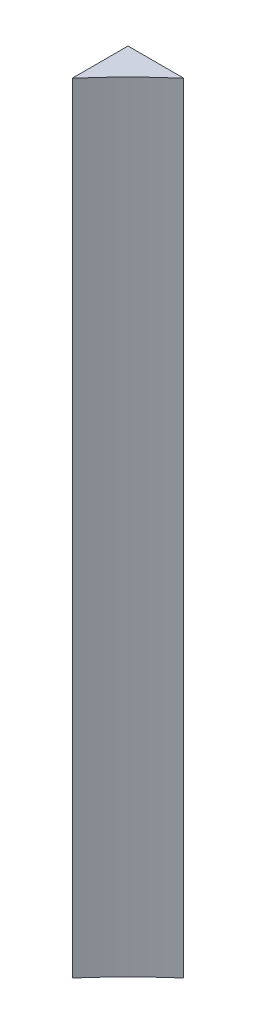
ISO-10303-21;
HEADER;
FILE_DESCRIPTION(('STEP AP214'),'2;1');
FILE_NAME('part.step','',(''),(''),'','','');
FILE_SCHEMA(('AUTOMOTIVE_DESIGN { 1 0 10303 214 1 1 1 1 }'));
ENDSEC;
DATA;
#1=APPLICATION_CONTEXT('core data for automotive mechanical design processes');
#2=APPLICATION_PROTOCOL_DEFINITION('international standard','automotive_design',2000,#1);
#3=PRODUCT_CONTEXT('',#1,'mechanical');
#4=PRODUCT('Part','Part','',(#3));
#5=PRODUCT_RELATED_PRODUCT_CATEGORY('part','',(#4));
#6=PRODUCT_DEFINITION_FORMATION('','',#4);
#7=PRODUCT_DEFINITION_CONTEXT('part definition',#1,'design');
#8=PRODUCT_DEFINITION('design','',#6,#7);
#9=PRODUCT_DEFINITION_SHAPE('','',#8);
#10=(LENGTH_UNIT() NAMED_UNIT(*) SI_UNIT(.MILLI.,.METRE.));
#11=(NAMED_UNIT(*) PLANE_ANGLE_UNIT() SI_UNIT($,.RADIAN.));
#12=(NAMED_UNIT(*) SI_UNIT($,.STERADIAN.) SOLID_ANGLE_UNIT());
#13=UNCERTAINTY_MEASURE_WITH_UNIT(LENGTH_MEASURE(1.E-05),#10,'distance_accuracy_value','');
#14=(GEOMETRIC_REPRESENTATION_CONTEXT(3) GLOBAL_UNCERTAINTY_ASSIGNED_CONTEXT((#13)) GLOBAL_UNIT_ASSIGNED_CONTEXT((#10,
#11,#12)) REPRESENTATION_CONTEXT('',''));
#15=CARTESIAN_POINT('',(0.,0.,0.));
#16=DIRECTION('',(0.,0.,1.));
#17=DIRECTION('',(1.,0.,0.));
#18=AXIS2_PLACEMENT_3D('',#15,#16,#17);
#19=CARTESIAN_POINT('',(1550.,225.,2.22044604925031E-13));
#20=DIRECTION('',(0.,0.,1.));
#21=DIRECTION('',(1.,0.,0.));
#22=AXIS2_PLACEMENT_3D('',#19,#20,#21);
#23=PLANE('',#22);
#24=DIRECTION('',(1.,0.,0.));
#25=VECTOR('',#24,1.);
#26=CARTESIAN_POINT('',(1550.,-74.9999999999999,2.43360885925031E-13));
#27=LINE('',#26,#25);
#28=CARTESIAN_POINT('',(1535.,-74.9999999999999,2.43360885925031E-13));
#29=VERTEX_POINT('',#28);
#30=CARTESIAN_POINT('',(1544.99999999999,-75.0000000000009,-1.94982918699793E-12));
#31=VERTEX_POINT('',#30);
#32=EDGE_CURVE('E107',#29,#31,#27,.T.);
#33=ORIENTED_EDGE('',*,*,#32,.F.);
#34=DIRECTION('',(0.,-1.,0.));
#35=VECTOR('',#34,1.);
#36=CARTESIAN_POINT('',(1535.,225.,2.22044604925031E-13));
#37=LINE('',#36,#35);
#38=CARTESIAN_POINT('',(1535.,64.8000000000001,2.33680889071644E-13));
#39=VERTEX_POINT('',#38);
#40=EDGE_CURVE('E87',#39,#29,#37,.T.);
#41=ORIENTED_EDGE('',*,*,#40,.F.);
#42=DIRECTION('',(-1.,0.,0.));
#43=VECTOR('',#42,1.);
#44=CARTESIAN_POINT('',(1550.,64.8000000000001,2.33427498979031E-13));
#45=LINE('',#44,#43);
#46=CARTESIAN_POINT('',(1545.,64.7999999999991,0.));
#47=VERTEX_POINT('',#46);
#48=EDGE_CURVE('E90',#47,#39,#45,.T.);
#49=ORIENTED_EDGE('',*,*,#48,.F.);
#50=DIRECTION('',(0.,-1.,0.));
#51=VECTOR('',#50,1.);
#52=CARTESIAN_POINT('',(1545.,64.8000000000001,0.));
#53=LINE('',#52,#51);
#54=EDGE_CURVE('E61',#31,#47,#53,.F.);
#55=ORIENTED_EDGE('',*,*,#54,.F.);
#56=EDGE_LOOP('',(#33,#41,#49,#55));
#57=FACE_BOUND('',#56,.T.);
#58=ADVANCED_FACE('F57',(#57),#23,.F.);
#59=CARTESIAN_POINT('',(1610.62228977098,-74.9999999999999,75.6222897709799));
#60=DIRECTION('',(0.,1.,0.));
#61=DIRECTION('',(0.,0.,1.));
#62=AXIS2_PLACEMENT_3D('',#59,#60,#61);
#63=PLANE('',#62);
#64=DIRECTION('',(0.,0.,-1.));
#65=VECTOR('',#64,1.);
#66=CARTESIAN_POINT('',(1535.,-74.9999999999999,2.63677968348475E-13));
#67=LINE('',#66,#65);
#68=CARTESIAN_POINT('',(1535.,-75.0000000000009,9.99999999999364));
#69=VERTEX_POINT('',#68);
#70=EDGE_CURVE('E106',#69,#29,#67,.T.);
#71=ORIENTED_EDGE('',*,*,#70,.T.);
#72=ORIENTED_EDGE('',*,*,#32,.T.);
#73=CARTESIAN_POINT('',(1610.62228977097,-75.0000000000041,75.6222897709757));
#74=DIRECTION('',(0.,-1.,0.));
#75=DIRECTION('',(0.,0.,-1.));
#76=AXIS2_PLACEMENT_3D('',#73,#74,#75);
#77=CIRCLE('',#76,100.124999999961);
#78=EDGE_CURVE('E100',#69,#31,#77,.T.);
#79=ORIENTED_EDGE('',*,*,#78,.F.);
#80=EDGE_LOOP('',(#71,#72,#79));
#81=FACE_BOUND('',#80,.T.);
#82=ADVANCED_FACE('F121',(#81),#63,.F.);
#83=CARTESIAN_POINT('',(1535.,65.,15.));
#84=DIRECTION('',(-1.,0.,0.));
#85=DIRECTION('',(0.,0.,1.));
#86=AXIS2_PLACEMENT_3D('',#83,#84,#85);
#87=PLANE('',#86);
#88=DIRECTION('',(0.,-1.,0.));
#89=VECTOR('',#88,1.);
#90=CARTESIAN_POINT('',(1535.,64.8000000000001,10.0000000000002));
#91=LINE('',#90,#89);
#92=CARTESIAN_POINT('',(1535.,64.7999999999991,10.0000000000002));
#93=VERTEX_POINT('',#92);
#94=EDGE_CURVE('E67',#93,#69,#91,.T.);
#95=ORIENTED_EDGE('',*,*,#94,.F.);
#96=DIRECTION('',(0.,0.,1.));
#97=VECTOR('',#96,1.);
#98=CARTESIAN_POINT('',(1535.,64.8000000000001,15.));
#99=LINE('',#98,#97);
#100=EDGE_CURVE('E94',#39,#93,#99,.T.);
#101=ORIENTED_EDGE('',*,*,#100,.F.);
#102=ORIENTED_EDGE('',*,*,#40,.T.);
#103=ORIENTED_EDGE('',*,*,#70,.F.);
#104=EDGE_LOOP('',(#95,#101,#102,#103));
#105=FACE_BOUND('',#104,.T.);
#106=ADVANCED_FACE('F123',(#105),#87,.T.);
#107=CARTESIAN_POINT('',(1610.62228977097,64.8000000000001,75.6222897709736));
#108=DIRECTION('',(0.,1.,0.));
#109=DIRECTION('',(0.,0.,1.));
#110=AXIS2_PLACEMENT_3D('',#107,#108,#109);
#111=PLANE('',#110);
#112=ORIENTED_EDGE('',*,*,#100,.T.);
#113=CARTESIAN_POINT('',(1610.62228977098,64.7999999999959,75.6222897709798));
#114=DIRECTION('',(0.,-1.,0.));
#115=DIRECTION('',(0.,0.,-1.));
#116=AXIS2_PLACEMENT_3D('',#113,#114,#115);
#117=CIRCLE('',#116,100.124999999961);
#118=EDGE_CURVE('E12',#47,#93,#117,.F.);
#119=ORIENTED_EDGE('',*,*,#118,.F.);
#120=ORIENTED_EDGE('',*,*,#48,.T.);
#121=EDGE_LOOP('',(#112,#119,#120));
#122=FACE_BOUND('',#121,.T.);
#123=ADVANCED_FACE('F96',(#122),#111,.T.);
#124=CARTESIAN_POINT('',(1610.62228977098,64.7999999999959,75.6222897709798));
#125=DIRECTION('',(0.,-1.,0.));
#126=DIRECTION('',(0.,0.,-1.));
#127=AXIS2_PLACEMENT_3D('',#124,#125,#126);
#128=CYLINDRICAL_SURFACE('',#127,100.124999999961);
#129=ORIENTED_EDGE('',*,*,#118,.T.);
#130=ORIENTED_EDGE('',*,*,#94,.T.);
#131=ORIENTED_EDGE('',*,*,#78,.T.);
#132=ORIENTED_EDGE('',*,*,#54,.T.);
#133=EDGE_LOOP('',(#129,#130,#131,#132));
#134=FACE_BOUND('',#133,.T.);
#135=ADVANCED_FACE('F59',(#134),#128,.F.);
#136=CLOSED_SHELL('',(#58,#82,#106,#123,#135));
#137=MANIFOLD_SOLID_BREP('B2',#136);
#138=ADVANCED_BREP_SHAPE_REPRESENTATION('',(#18,#137),#14);
#139=SHAPE_DEFINITION_REPRESENTATION(#9,#138);
ENDSEC;
END-ISO-10303-21;
